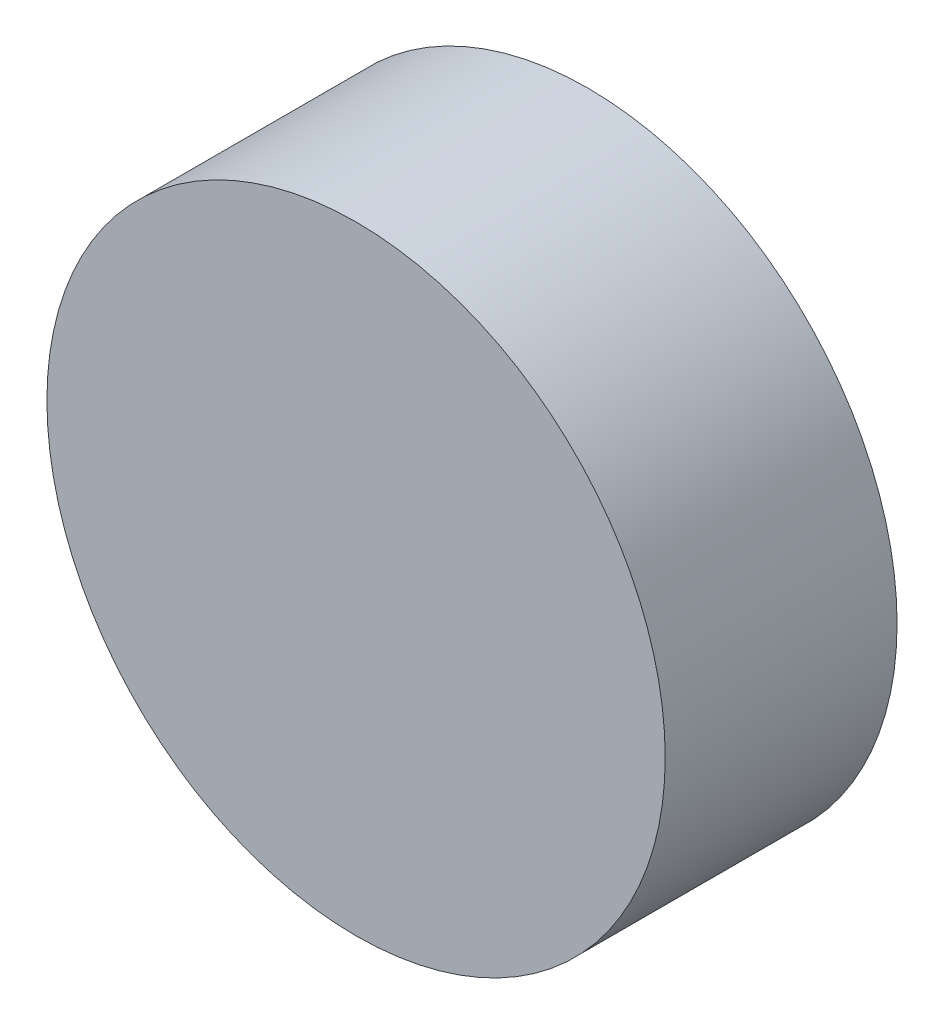
ISO-10303-21;
HEADER;
FILE_DESCRIPTION(('STEP AP214'),'2;1');
FILE_NAME('part.step','',(''),(''),'','','');
FILE_SCHEMA(('AUTOMOTIVE_DESIGN { 1 0 10303 214 1 1 1 1 }'));
ENDSEC;
DATA;
#1=APPLICATION_CONTEXT('core data for automotive mechanical design processes');
#2=APPLICATION_PROTOCOL_DEFINITION('international standard','automotive_design',2000,#1);
#3=PRODUCT_CONTEXT('',#1,'mechanical');
#4=PRODUCT('Part','Part','',(#3));
#5=PRODUCT_RELATED_PRODUCT_CATEGORY('part','',(#4));
#6=PRODUCT_DEFINITION_FORMATION('','',#4);
#7=PRODUCT_DEFINITION_CONTEXT('part definition',#1,'design');
#8=PRODUCT_DEFINITION('design','',#6,#7);
#9=PRODUCT_DEFINITION_SHAPE('','',#8);
#10=(LENGTH_UNIT() NAMED_UNIT(*) SI_UNIT(.MILLI.,.METRE.));
#11=(NAMED_UNIT(*) PLANE_ANGLE_UNIT() SI_UNIT($,.RADIAN.));
#12=(NAMED_UNIT(*) SI_UNIT($,.STERADIAN.) SOLID_ANGLE_UNIT());
#13=UNCERTAINTY_MEASURE_WITH_UNIT(LENGTH_MEASURE(1.E-05),#10,'distance_accuracy_value','');
#14=(GEOMETRIC_REPRESENTATION_CONTEXT(3) GLOBAL_UNCERTAINTY_ASSIGNED_CONTEXT((#13)) GLOBAL_UNIT_ASSIGNED_CONTEXT((#10,
#11,#12)) REPRESENTATION_CONTEXT('',''));
#15=CARTESIAN_POINT('',(0.,0.,0.));
#16=DIRECTION('',(0.,0.,1.));
#17=DIRECTION('',(1.,0.,0.));
#18=AXIS2_PLACEMENT_3D('',#15,#16,#17);
#19=CARTESIAN_POINT('',(0.,0.,3.));
#20=DIRECTION('',(0.,0.,-1.));
#21=DIRECTION('',(-1.,0.,0.));
#22=AXIS2_PLACEMENT_3D('',#19,#20,#21);
#23=CYLINDRICAL_SURFACE('',#22,4.);
#24=CARTESIAN_POINT('',(0.,0.,3.));
#25=DIRECTION('',(0.,0.,1.));
#26=DIRECTION('',(1.,0.,0.));
#27=AXIS2_PLACEMENT_3D('',#24,#25,#26);
#28=CIRCLE('',#27,4.);
#29=CARTESIAN_POINT('',(4.,0.,3.));
#30=VERTEX_POINT('',#29);
#31=EDGE_CURVE('E10',#30,#30,#28,.T.);
#32=ORIENTED_EDGE('',*,*,#31,.F.);
#33=EDGE_LOOP('',(#32));
#34=FACE_BOUND('',#33,.T.);
#35=CARTESIAN_POINT('',(0.,0.,0.));
#36=DIRECTION('',(0.,0.,1.));
#37=DIRECTION('',(1.,0.,0.));
#38=AXIS2_PLACEMENT_3D('',#35,#36,#37);
#39=CIRCLE('',#38,4.);
#40=CARTESIAN_POINT('',(4.,0.,0.));
#41=VERTEX_POINT('',#40);
#42=EDGE_CURVE('E42',#41,#41,#39,.T.);
#43=ORIENTED_EDGE('',*,*,#42,.T.);
#44=EDGE_LOOP('',(#43));
#45=FACE_BOUND('',#44,.T.);
#46=ADVANCED_FACE('F39',(#34,#45),#23,.T.);
#47=CARTESIAN_POINT('',(0.,0.,3.));
#48=DIRECTION('',(0.,0.,1.));
#49=DIRECTION('',(1.,0.,0.));
#50=AXIS2_PLACEMENT_3D('',#47,#48,#49);
#51=PLANE('',#50);
#52=ORIENTED_EDGE('',*,*,#31,.T.);
#53=EDGE_LOOP('',(#52));
#54=FACE_BOUND('',#53,.T.);
#55=ADVANCED_FACE('F54',(#54),#51,.T.);
#56=CARTESIAN_POINT('',(0.,0.,0.));
#57=DIRECTION('',(0.,0.,1.));
#58=DIRECTION('',(1.,0.,0.));
#59=AXIS2_PLACEMENT_3D('',#56,#57,#58);
#60=PLANE('',#59);
#61=ORIENTED_EDGE('',*,*,#42,.F.);
#62=EDGE_LOOP('',(#61));
#63=FACE_BOUND('',#62,.T.);
#64=ADVANCED_FACE('F52',(#63),#60,.F.);
#65=CLOSED_SHELL('',(#46,#55,#64));
#66=MANIFOLD_SOLID_BREP('B2',#65);
#67=ADVANCED_BREP_SHAPE_REPRESENTATION('',(#18,#66),#14);
#68=SHAPE_DEFINITION_REPRESENTATION(#9,#67);
ENDSEC;
END-ISO-10303-21;
